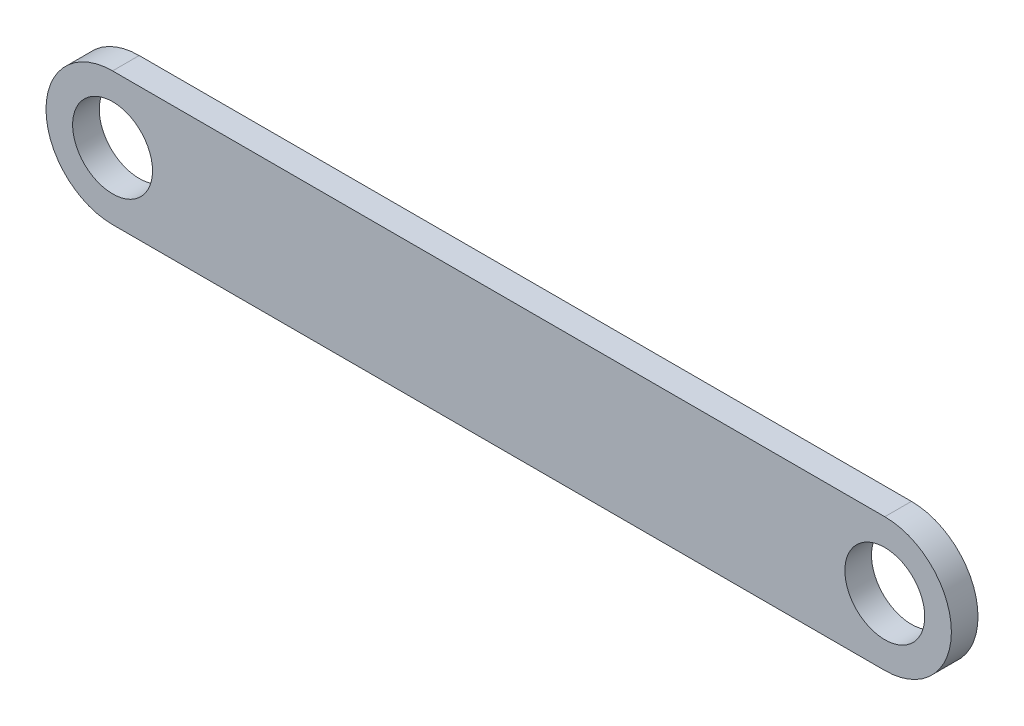
ISO-10303-21;
HEADER;
FILE_DESCRIPTION(('STEP AP214'),'2;1');
FILE_NAME('part.step','',(''),(''),'','','');
FILE_SCHEMA(('AUTOMOTIVE_DESIGN { 1 0 10303 214 1 1 1 1 }'));
ENDSEC;
DATA;
#1=APPLICATION_CONTEXT('core data for automotive mechanical design processes');
#2=APPLICATION_PROTOCOL_DEFINITION('international standard','automotive_design',2000,#1);
#3=PRODUCT_CONTEXT('',#1,'mechanical');
#4=PRODUCT('Part','Part','',(#3));
#5=PRODUCT_RELATED_PRODUCT_CATEGORY('part','',(#4));
#6=PRODUCT_DEFINITION_FORMATION('','',#4);
#7=PRODUCT_DEFINITION_CONTEXT('part definition',#1,'design');
#8=PRODUCT_DEFINITION('design','',#6,#7);
#9=PRODUCT_DEFINITION_SHAPE('','',#8);
#10=(LENGTH_UNIT() NAMED_UNIT(*) SI_UNIT(.MILLI.,.METRE.));
#11=(NAMED_UNIT(*) PLANE_ANGLE_UNIT() SI_UNIT($,.RADIAN.));
#12=(NAMED_UNIT(*) SI_UNIT($,.STERADIAN.) SOLID_ANGLE_UNIT());
#13=UNCERTAINTY_MEASURE_WITH_UNIT(LENGTH_MEASURE(1.E-05),#10,'distance_accuracy_value','');
#14=(GEOMETRIC_REPRESENTATION_CONTEXT(3) GLOBAL_UNCERTAINTY_ASSIGNED_CONTEXT((#13)) GLOBAL_UNIT_ASSIGNED_CONTEXT((#10,
#11,#12)) REPRESENTATION_CONTEXT('',''));
#15=CARTESIAN_POINT('',(0.,0.,0.));
#16=DIRECTION('',(0.,0.,1.));
#17=DIRECTION('',(1.,0.,0.));
#18=AXIS2_PLACEMENT_3D('',#15,#16,#17);
#19=CARTESIAN_POINT('',(0.,0.,2.5));
#20=DIRECTION('',(0.,0.,1.));
#21=DIRECTION('',(1.,0.,0.));
#22=AXIS2_PLACEMENT_3D('',#19,#20,#21);
#23=PLANE('',#22);
#24=CARTESIAN_POINT('',(0.,0.,2.5));
#25=DIRECTION('',(0.,0.,1.));
#26=DIRECTION('',(1.,0.,0.));
#27=AXIS2_PLACEMENT_3D('',#24,#25,#26);
#28=CIRCLE('',#27,7.5);
#29=CARTESIAN_POINT('',(7.5,0.,2.5));
#30=VERTEX_POINT('',#29);
#31=EDGE_CURVE('E99',#30,#30,#28,.T.);
#32=ORIENTED_EDGE('',*,*,#31,.F.);
#33=EDGE_LOOP('',(#32));
#34=FACE_BOUND('',#33,.T.);
#35=CARTESIAN_POINT('',(0.,0.,2.5));
#36=DIRECTION('',(0.,0.,1.));
#37=DIRECTION('',(1.,0.,0.));
#38=AXIS2_PLACEMENT_3D('',#35,#36,#37);
#39=CIRCLE('',#38,12.5);
#40=CARTESIAN_POINT('',(0.,12.5,2.5));
#41=VERTEX_POINT('',#40);
#42=CARTESIAN_POINT('',(0.,-12.5,2.5));
#43=VERTEX_POINT('',#42);
#44=EDGE_CURVE('E84',#41,#43,#39,.T.);
#45=ORIENTED_EDGE('',*,*,#44,.T.);
#46=DIRECTION('',(1.,0.,0.));
#47=VECTOR('',#46,1.);
#48=CARTESIAN_POINT('',(0.,-12.5,2.5));
#49=LINE('',#48,#47);
#50=CARTESIAN_POINT('',(145.,-12.5,2.5));
#51=VERTEX_POINT('',#50);
#52=EDGE_CURVE('E79',#43,#51,#49,.T.);
#53=ORIENTED_EDGE('',*,*,#52,.T.);
#54=CARTESIAN_POINT('',(145.,0.,2.5));
#55=DIRECTION('',(0.,0.,1.));
#56=DIRECTION('',(1.,0.,0.));
#57=AXIS2_PLACEMENT_3D('',#54,#55,#56);
#58=CIRCLE('',#57,12.5);
#59=CARTESIAN_POINT('',(145.,12.5,2.5));
#60=VERTEX_POINT('',#59);
#61=EDGE_CURVE('E82',#51,#60,#58,.T.);
#62=ORIENTED_EDGE('',*,*,#61,.T.);
#63=DIRECTION('',(-1.,0.,0.));
#64=VECTOR('',#63,1.);
#65=CARTESIAN_POINT('',(0.,12.5,2.5));
#66=LINE('',#65,#64);
#67=EDGE_CURVE('E49',#60,#41,#66,.T.);
#68=ORIENTED_EDGE('',*,*,#67,.T.);
#69=EDGE_LOOP('',(#45,#53,#62,#68));
#70=FACE_BOUND('',#69,.T.);
#71=CARTESIAN_POINT('',(145.,0.,2.5));
#72=DIRECTION('',(0.,0.,1.));
#73=DIRECTION('',(1.,0.,0.));
#74=AXIS2_PLACEMENT_3D('',#71,#72,#73);
#75=CIRCLE('',#74,7.50000000000001);
#76=CARTESIAN_POINT('',(152.5,0.,2.5));
#77=VERTEX_POINT('',#76);
#78=EDGE_CURVE('E114',#77,#77,#75,.T.);
#79=ORIENTED_EDGE('',*,*,#78,.F.);
#80=EDGE_LOOP('',(#79));
#81=FACE_BOUND('',#80,.T.);
#82=ADVANCED_FACE('F32',(#34,#70,#81),#23,.T.);
#83=CARTESIAN_POINT('',(0.,0.,-2.5));
#84=DIRECTION('',(0.,0.,1.));
#85=DIRECTION('',(1.,0.,0.));
#86=AXIS2_PLACEMENT_3D('',#83,#84,#85);
#87=PLANE('',#86);
#88=CARTESIAN_POINT('',(0.,0.,-2.5));
#89=DIRECTION('',(0.,0.,1.));
#90=DIRECTION('',(1.,0.,0.));
#91=AXIS2_PLACEMENT_3D('',#88,#89,#90);
#92=CIRCLE('',#91,12.5);
#93=CARTESIAN_POINT('',(0.,12.5,-2.5));
#94=VERTEX_POINT('',#93);
#95=CARTESIAN_POINT('',(0.,-12.5,-2.5));
#96=VERTEX_POINT('',#95);
#97=EDGE_CURVE('E96',#94,#96,#92,.T.);
#98=ORIENTED_EDGE('',*,*,#97,.F.);
#99=DIRECTION('',(-1.,0.,0.));
#100=VECTOR('',#99,1.);
#101=CARTESIAN_POINT('',(0.,12.5,-2.5));
#102=LINE('',#101,#100);
#103=CARTESIAN_POINT('',(145.,12.5,-2.5));
#104=VERTEX_POINT('',#103);
#105=EDGE_CURVE('E72',#104,#94,#102,.T.);
#106=ORIENTED_EDGE('',*,*,#105,.F.);
#107=CARTESIAN_POINT('',(145.,0.,-2.5));
#108=DIRECTION('',(0.,0.,1.));
#109=DIRECTION('',(1.,0.,0.));
#110=AXIS2_PLACEMENT_3D('',#107,#108,#109);
#111=CIRCLE('',#110,12.5);
#112=CARTESIAN_POINT('',(145.,-12.5,-2.5));
#113=VERTEX_POINT('',#112);
#114=EDGE_CURVE('E66',#113,#104,#111,.T.);
#115=ORIENTED_EDGE('',*,*,#114,.F.);
#116=DIRECTION('',(1.,0.,0.));
#117=VECTOR('',#116,1.);
#118=CARTESIAN_POINT('',(0.,-12.5,-2.5));
#119=LINE('',#118,#117);
#120=EDGE_CURVE('E88',#96,#113,#119,.T.);
#121=ORIENTED_EDGE('',*,*,#120,.F.);
#122=EDGE_LOOP('',(#98,#106,#115,#121));
#123=FACE_BOUND('',#122,.T.);
#124=CARTESIAN_POINT('',(0.,0.,-2.5));
#125=DIRECTION('',(0.,0.,1.));
#126=DIRECTION('',(1.,0.,0.));
#127=AXIS2_PLACEMENT_3D('',#124,#125,#126);
#128=CIRCLE('',#127,7.5);
#129=CARTESIAN_POINT('',(7.5,0.,-2.5));
#130=VERTEX_POINT('',#129);
#131=EDGE_CURVE('E111',#130,#130,#128,.T.);
#132=ORIENTED_EDGE('',*,*,#131,.T.);
#133=EDGE_LOOP('',(#132));
#134=FACE_BOUND('',#133,.T.);
#135=CARTESIAN_POINT('',(145.,0.,-2.5));
#136=DIRECTION('',(0.,0.,1.));
#137=DIRECTION('',(1.,0.,0.));
#138=AXIS2_PLACEMENT_3D('',#135,#136,#137);
#139=CIRCLE('',#138,7.50000000000001);
#140=CARTESIAN_POINT('',(152.5,0.,-2.5));
#141=VERTEX_POINT('',#140);
#142=EDGE_CURVE('E117',#141,#141,#139,.T.);
#143=ORIENTED_EDGE('',*,*,#142,.T.);
#144=EDGE_LOOP('',(#143));
#145=FACE_BOUND('',#144,.T.);
#146=ADVANCED_FACE('F107',(#123,#134,#145),#87,.F.);
#147=CARTESIAN_POINT('',(0.,0.,2.5));
#148=DIRECTION('',(0.,0.,-1.));
#149=DIRECTION('',(-1.,0.,0.));
#150=AXIS2_PLACEMENT_3D('',#147,#148,#149);
#151=CYLINDRICAL_SURFACE('',#150,12.5);
#152=ORIENTED_EDGE('',*,*,#97,.T.);
#153=DIRECTION('',(0.,0.,-1.));
#154=VECTOR('',#153,1.);
#155=CARTESIAN_POINT('',(0.,-12.5,2.5));
#156=LINE('',#155,#154);
#157=EDGE_CURVE('E11',#43,#96,#156,.T.);
#158=ORIENTED_EDGE('',*,*,#157,.F.);
#159=ORIENTED_EDGE('',*,*,#44,.F.);
#160=DIRECTION('',(0.,0.,-1.));
#161=VECTOR('',#160,1.);
#162=CARTESIAN_POINT('',(0.,12.5,2.5));
#163=LINE('',#162,#161);
#164=EDGE_CURVE('E92',#41,#94,#163,.T.);
#165=ORIENTED_EDGE('',*,*,#164,.T.);
#166=EDGE_LOOP('',(#152,#158,#159,#165));
#167=FACE_BOUND('',#166,.T.);
#168=ADVANCED_FACE('F34',(#167),#151,.T.);
#169=CARTESIAN_POINT('',(0.,-12.5,2.5));
#170=DIRECTION('',(0.,1.,0.));
#171=DIRECTION('',(-1.,0.,0.));
#172=AXIS2_PLACEMENT_3D('',#169,#170,#171);
#173=PLANE('',#172);
#174=ORIENTED_EDGE('',*,*,#120,.T.);
#175=DIRECTION('',(0.,0.,-1.));
#176=VECTOR('',#175,1.);
#177=CARTESIAN_POINT('',(145.,-12.5,2.5));
#178=LINE('',#177,#176);
#179=EDGE_CURVE('E41',#51,#113,#178,.T.);
#180=ORIENTED_EDGE('',*,*,#179,.F.);
#181=ORIENTED_EDGE('',*,*,#52,.F.);
#182=ORIENTED_EDGE('',*,*,#157,.T.);
#183=EDGE_LOOP('',(#174,#180,#181,#182));
#184=FACE_BOUND('',#183,.T.);
#185=ADVANCED_FACE('F87',(#184),#173,.F.);
#186=CARTESIAN_POINT('',(145.,0.,2.5));
#187=DIRECTION('',(0.,0.,-1.));
#188=DIRECTION('',(-1.,0.,0.));
#189=AXIS2_PLACEMENT_3D('',#186,#187,#188);
#190=CYLINDRICAL_SURFACE('',#189,12.5);
#191=ORIENTED_EDGE('',*,*,#114,.T.);
#192=DIRECTION('',(0.,0.,-1.));
#193=VECTOR('',#192,1.);
#194=CARTESIAN_POINT('',(145.,12.5,2.5));
#195=LINE('',#194,#193);
#196=EDGE_CURVE('E89',#60,#104,#195,.T.);
#197=ORIENTED_EDGE('',*,*,#196,.F.);
#198=ORIENTED_EDGE('',*,*,#61,.F.);
#199=ORIENTED_EDGE('',*,*,#179,.T.);
#200=EDGE_LOOP('',(#191,#197,#198,#199));
#201=FACE_BOUND('',#200,.T.);
#202=ADVANCED_FACE('F90',(#201),#190,.T.);
#203=CARTESIAN_POINT('',(0.,12.5,2.5));
#204=DIRECTION('',(0.,-1.,0.));
#205=DIRECTION('',(1.,0.,0.));
#206=AXIS2_PLACEMENT_3D('',#203,#204,#205);
#207=PLANE('',#206);
#208=ORIENTED_EDGE('',*,*,#105,.T.);
#209=ORIENTED_EDGE('',*,*,#164,.F.);
#210=ORIENTED_EDGE('',*,*,#67,.F.);
#211=ORIENTED_EDGE('',*,*,#196,.T.);
#212=EDGE_LOOP('',(#208,#209,#210,#211));
#213=FACE_BOUND('',#212,.T.);
#214=ADVANCED_FACE('F104',(#213),#207,.F.);
#215=CARTESIAN_POINT('',(0.,0.,2.5));
#216=DIRECTION('',(0.,0.,-1.));
#217=DIRECTION('',(-1.,0.,0.));
#218=AXIS2_PLACEMENT_3D('',#215,#216,#217);
#219=CYLINDRICAL_SURFACE('',#218,7.5);
#220=ORIENTED_EDGE('',*,*,#31,.T.);
#221=EDGE_LOOP('',(#220));
#222=FACE_BOUND('',#221,.T.);
#223=ORIENTED_EDGE('',*,*,#131,.F.);
#224=EDGE_LOOP('',(#223));
#225=FACE_BOUND('',#224,.T.);
#226=ADVANCED_FACE('F134',(#222,#225),#219,.F.);
#227=CARTESIAN_POINT('',(145.,0.,2.5));
#228=DIRECTION('',(0.,0.,-1.));
#229=DIRECTION('',(-1.,0.,0.));
#230=AXIS2_PLACEMENT_3D('',#227,#228,#229);
#231=CYLINDRICAL_SURFACE('',#230,7.50000000000001);
#232=ORIENTED_EDGE('',*,*,#78,.T.);
#233=EDGE_LOOP('',(#232));
#234=FACE_BOUND('',#233,.T.);
#235=ORIENTED_EDGE('',*,*,#142,.F.);
#236=EDGE_LOOP('',(#235));
#237=FACE_BOUND('',#236,.T.);
#238=ADVANCED_FACE('F123',(#234,#237),#231,.F.);
#239=CLOSED_SHELL('',(#82,#146,#168,#185,#202,#214,#226,#238));
#240=MANIFOLD_SOLID_BREP('B2',#239);
#241=ADVANCED_BREP_SHAPE_REPRESENTATION('',(#18,#240),#14);
#242=SHAPE_DEFINITION_REPRESENTATION(#9,#241);
ENDSEC;
END-ISO-10303-21;
